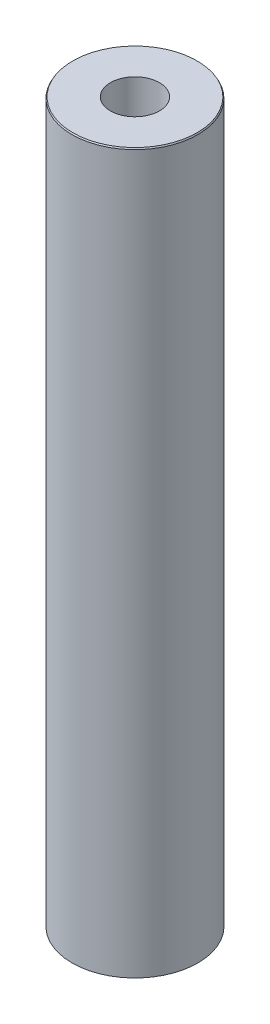
ISO-10303-21;
HEADER;
FILE_DESCRIPTION(('STEP AP214'),'2;1');
FILE_NAME('part.step','',(''),(''),'','','');
FILE_SCHEMA(('AUTOMOTIVE_DESIGN { 1 0 10303 214 1 1 1 1 }'));
ENDSEC;
DATA;
#1=APPLICATION_CONTEXT('core data for automotive mechanical design processes');
#2=APPLICATION_PROTOCOL_DEFINITION('international standard','automotive_design',2000,#1);
#3=PRODUCT_CONTEXT('',#1,'mechanical');
#4=PRODUCT('Part','Part','',(#3));
#5=PRODUCT_RELATED_PRODUCT_CATEGORY('part','',(#4));
#6=PRODUCT_DEFINITION_FORMATION('','',#4);
#7=PRODUCT_DEFINITION_CONTEXT('part definition',#1,'design');
#8=PRODUCT_DEFINITION('design','',#6,#7);
#9=PRODUCT_DEFINITION_SHAPE('','',#8);
#10=(LENGTH_UNIT() NAMED_UNIT(*) SI_UNIT(.MILLI.,.METRE.));
#11=(NAMED_UNIT(*) PLANE_ANGLE_UNIT() SI_UNIT($,.RADIAN.));
#12=(NAMED_UNIT(*) SI_UNIT($,.STERADIAN.) SOLID_ANGLE_UNIT());
#13=UNCERTAINTY_MEASURE_WITH_UNIT(LENGTH_MEASURE(1.E-05),#10,'distance_accuracy_value','');
#14=(GEOMETRIC_REPRESENTATION_CONTEXT(3) GLOBAL_UNCERTAINTY_ASSIGNED_CONTEXT((#13)) GLOBAL_UNIT_ASSIGNED_CONTEXT((#10,
#11,#12)) REPRESENTATION_CONTEXT('',''));
#15=CARTESIAN_POINT('',(0.,0.,0.));
#16=DIRECTION('',(0.,0.,1.));
#17=DIRECTION('',(1.,0.,0.));
#18=AXIS2_PLACEMENT_3D('',#15,#16,#17);
#19=CARTESIAN_POINT('',(0.,600.,0.));
#20=DIRECTION('',(0.,-1.,0.));
#21=DIRECTION('',(0.,0.,-1.));
#22=AXIS2_PLACEMENT_3D('',#19,#20,#21);
#23=CYLINDRICAL_SURFACE('',#22,52.5);
#24=CARTESIAN_POINT('',(0.,598.923413441903,0.));
#25=DIRECTION('',(0.,1.,0.));
#26=DIRECTION('',(0.,0.,1.));
#27=AXIS2_PLACEMENT_3D('',#24,#25,#26);
#28=CIRCLE('',#27,52.5);
#29=CARTESIAN_POINT('',(0.,598.923413441903,52.5));
#30=VERTEX_POINT('',#29);
#31=EDGE_CURVE('E50',#30,#30,#28,.F.);
#32=ORIENTED_EDGE('',*,*,#31,.T.);
#33=EDGE_LOOP('',(#32));
#34=FACE_BOUND('',#33,.T.);
#35=CARTESIAN_POINT('',(0.,0.621567539123125,0.));
#36=DIRECTION('',(0.,1.,0.));
#37=DIRECTION('',(0.,0.,1.));
#38=AXIS2_PLACEMENT_3D('',#35,#36,#37);
#39=CIRCLE('',#38,52.5);
#40=CARTESIAN_POINT('',(0.,0.621567539123125,52.5));
#41=VERTEX_POINT('',#40);
#42=EDGE_CURVE('E51',#41,#41,#39,.T.);
#43=ORIENTED_EDGE('',*,*,#42,.T.);
#44=EDGE_LOOP('',(#43));
#45=FACE_BOUND('',#44,.T.);
#46=ADVANCED_FACE('F39',(#34,#45),#23,.T.);
#47=CARTESIAN_POINT('',(0.,600.,0.));
#48=DIRECTION('',(0.,1.,0.));
#49=DIRECTION('',(0.,0.,1.));
#50=AXIS2_PLACEMENT_3D('',#47,#48,#49);
#51=PLANE('',#50);
#52=CARTESIAN_POINT('',(0.,600.,0.));
#53=DIRECTION('',(0.,1.,0.));
#54=DIRECTION('',(0.,0.,1.));
#55=AXIS2_PLACEMENT_3D('',#52,#53,#54);
#56=CIRCLE('',#55,51.8784324608769);
#57=CARTESIAN_POINT('',(0.,600.,51.8784324608769));
#58=VERTEX_POINT('',#57);
#59=EDGE_CURVE('E54',#58,#58,#56,.T.);
#60=ORIENTED_EDGE('',*,*,#59,.T.);
#61=EDGE_LOOP('',(#60));
#62=FACE_BOUND('',#61,.T.);
#63=CARTESIAN_POINT('',(0.,600.,0.));
#64=DIRECTION('',(0.,1.,0.));
#65=DIRECTION('',(0.,0.,1.));
#66=AXIS2_PLACEMENT_3D('',#63,#64,#65);
#67=CIRCLE('',#66,20.4407995840682);
#68=CARTESIAN_POINT('',(0.,600.,20.4407995840682));
#69=VERTEX_POINT('',#68);
#70=EDGE_CURVE('E58',#69,#69,#67,.T.);
#71=ORIENTED_EDGE('',*,*,#70,.F.);
#72=EDGE_LOOP('',(#71));
#73=FACE_BOUND('',#72,.T.);
#74=ADVANCED_FACE('F69',(#62,#73),#51,.T.);
#75=CARTESIAN_POINT('',(0.,0.,0.));
#76=DIRECTION('',(0.,1.,0.));
#77=DIRECTION('',(0.,0.,1.));
#78=AXIS2_PLACEMENT_3D('',#75,#76,#77);
#79=PLANE('',#78);
#80=CARTESIAN_POINT('',(0.,0.,0.));
#81=DIRECTION('',(0.,1.,0.));
#82=DIRECTION('',(0.,0.,1.));
#83=AXIS2_PLACEMENT_3D('',#80,#81,#82);
#84=CIRCLE('',#83,51.4234134419031);
#85=CARTESIAN_POINT('',(0.,0.,51.4234134419031));
#86=VERTEX_POINT('',#85);
#87=EDGE_CURVE('E10',#86,#86,#84,.F.);
#88=ORIENTED_EDGE('',*,*,#87,.T.);
#89=EDGE_LOOP('',(#88));
#90=FACE_BOUND('',#89,.T.);
#91=CARTESIAN_POINT('',(0.,0.,0.));
#92=DIRECTION('',(0.,1.,0.));
#93=DIRECTION('',(0.,0.,1.));
#94=AXIS2_PLACEMENT_3D('',#91,#92,#93);
#95=CIRCLE('',#94,20.4407995840682);
#96=CARTESIAN_POINT('',(0.,0.,20.4407995840682));
#97=VERTEX_POINT('',#96);
#98=EDGE_CURVE('E63',#97,#97,#95,.T.);
#99=ORIENTED_EDGE('',*,*,#98,.T.);
#100=EDGE_LOOP('',(#99));
#101=FACE_BOUND('',#100,.T.);
#102=ADVANCED_FACE('F75',(#90,#101),#79,.F.);
#103=CARTESIAN_POINT('',(0.,600.,0.));
#104=DIRECTION('',(0.,-1.,0.));
#105=DIRECTION('',(0.,0.,-1.));
#106=AXIS2_PLACEMENT_3D('',#103,#104,#105);
#107=CYLINDRICAL_SURFACE('',#106,20.4407995840682);
#108=ORIENTED_EDGE('',*,*,#70,.T.);
#109=EDGE_LOOP('',(#108));
#110=FACE_BOUND('',#109,.T.);
#111=ORIENTED_EDGE('',*,*,#98,.F.);
#112=EDGE_LOOP('',(#111));
#113=FACE_BOUND('',#112,.T.);
#114=ADVANCED_FACE('F70',(#110,#113),#107,.F.);
#115=CARTESIAN_POINT('',(0.,600.,0.));
#116=DIRECTION('',(0.,-1.,0.));
#117=DIRECTION('',(0.,0.,-1.));
#118=AXIS2_PLACEMENT_3D('',#115,#116,#117);
#119=CONICAL_SURFACE('',#118,51.8784324608769,0.523598775598337);
#120=ORIENTED_EDGE('',*,*,#31,.F.);
#121=EDGE_LOOP('',(#120));
#122=FACE_BOUND('',#121,.T.);
#123=ORIENTED_EDGE('',*,*,#59,.F.);
#124=EDGE_LOOP('',(#123));
#125=FACE_BOUND('',#124,.T.);
#126=ADVANCED_FACE('F81',(#122,#125),#119,.T.);
#127=CARTESIAN_POINT('',(0.,0.621567539123125,0.));
#128=DIRECTION('',(0.,1.,0.));
#129=DIRECTION('',(0.,0.,1.));
#130=AXIS2_PLACEMENT_3D('',#127,#128,#129);
#131=CONICAL_SURFACE('',#130,52.5,1.04719755119663);
#132=ORIENTED_EDGE('',*,*,#87,.F.);
#133=EDGE_LOOP('',(#132));
#134=FACE_BOUND('',#133,.T.);
#135=ORIENTED_EDGE('',*,*,#42,.F.);
#136=EDGE_LOOP('',(#135));
#137=FACE_BOUND('',#136,.T.);
#138=ADVANCED_FACE('F45',(#134,#137),#131,.T.);
#139=CLOSED_SHELL('',(#46,#74,#102,#114,#126,#138));
#140=MANIFOLD_SOLID_BREP('B2',#139);
#141=ADVANCED_BREP_SHAPE_REPRESENTATION('',(#18,#140),#14);
#142=SHAPE_DEFINITION_REPRESENTATION(#9,#141);
ENDSEC;
END-ISO-10303-21;
